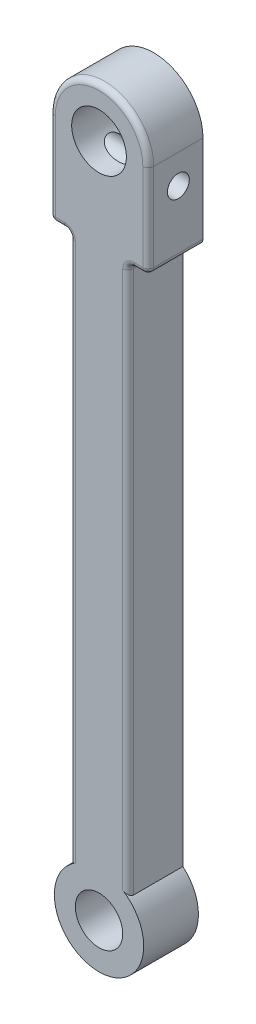
ISO-10303-21;
HEADER;
FILE_DESCRIPTION(('STEP AP214'),'2;1');
FILE_NAME('part.step','',(''),(''),'','','');
FILE_SCHEMA(('AUTOMOTIVE_DESIGN { 1 0 10303 214 1 1 1 1 }'));
ENDSEC;
DATA;
#1=APPLICATION_CONTEXT('core data for automotive mechanical design processes');
#2=APPLICATION_PROTOCOL_DEFINITION('international standard','automotive_design',2000,#1);
#3=PRODUCT_CONTEXT('',#1,'mechanical');
#4=PRODUCT('Part','Part','',(#3));
#5=PRODUCT_RELATED_PRODUCT_CATEGORY('part','',(#4));
#6=PRODUCT_DEFINITION_FORMATION('','',#4);
#7=PRODUCT_DEFINITION_CONTEXT('part definition',#1,'design');
#8=PRODUCT_DEFINITION('design','',#6,#7);
#9=PRODUCT_DEFINITION_SHAPE('','',#8);
#10=(LENGTH_UNIT() NAMED_UNIT(*) SI_UNIT(.MILLI.,.METRE.));
#11=(NAMED_UNIT(*) PLANE_ANGLE_UNIT() SI_UNIT($,.RADIAN.));
#12=(NAMED_UNIT(*) SI_UNIT($,.STERADIAN.) SOLID_ANGLE_UNIT());
#13=UNCERTAINTY_MEASURE_WITH_UNIT(LENGTH_MEASURE(1.E-05),#10,'distance_accuracy_value','');
#14=(GEOMETRIC_REPRESENTATION_CONTEXT(3) GLOBAL_UNCERTAINTY_ASSIGNED_CONTEXT((#13)) GLOBAL_UNIT_ASSIGNED_CONTEXT((#10,
#11,#12)) REPRESENTATION_CONTEXT('',''));
#15=CARTESIAN_POINT('',(0.,0.,0.));
#16=DIRECTION('',(0.,0.,1.));
#17=DIRECTION('',(1.,0.,0.));
#18=AXIS2_PLACEMENT_3D('',#15,#16,#17);
#19=CARTESIAN_POINT('',(0.,0.,15.));
#20=DIRECTION('',(0.,0.,1.));
#21=DIRECTION('',(1.,0.,0.));
#22=AXIS2_PLACEMENT_3D('',#19,#20,#21);
#23=PLANE('',#22);
#24=CARTESIAN_POINT('',(0.,-185.,15.));
#25=DIRECTION('',(0.,0.,1.));
#26=DIRECTION('',(1.,0.,0.));
#27=AXIS2_PLACEMENT_3D('',#24,#25,#26);
#28=CIRCLE('',#27,12.25);
#29=CARTESIAN_POINT('',(-6.49999999999998,-174.616720171352,15.));
#30=VERTEX_POINT('',#29);
#31=CARTESIAN_POINT('',(6.50000000000002,-174.616720171352,15.));
#32=VERTEX_POINT('',#31);
#33=EDGE_CURVE('E199',#30,#32,#28,.T.);
#34=ORIENTED_EDGE('',*,*,#33,.T.);
#35=DIRECTION('',(0.,1.,0.));
#36=VECTOR('',#35,1.);
#37=CARTESIAN_POINT('',(6.49999999999999,-27.,15.));
#38=LINE('',#37,#36);
#39=CARTESIAN_POINT('',(6.49999999999999,-27.,15.));
#40=VERTEX_POINT('',#39);
#41=EDGE_CURVE('E265',#32,#40,#38,.T.);
#42=ORIENTED_EDGE('',*,*,#41,.T.);
#43=CARTESIAN_POINT('',(9.49999999999999,-27.,15.));
#44=DIRECTION('',(0.,0.,1.));
#45=DIRECTION('',(1.,0.,0.));
#46=AXIS2_PLACEMENT_3D('',#43,#44,#45);
#47=CIRCLE('',#46,3.);
#48=CARTESIAN_POINT('',(9.50000000000001,-24.,15.));
#49=VERTEX_POINT('',#48);
#50=EDGE_CURVE('E263',#40,#49,#47,.F.);
#51=ORIENTED_EDGE('',*,*,#50,.T.);
#52=DIRECTION('',(1.,0.,0.));
#53=VECTOR('',#52,1.);
#54=CARTESIAN_POINT('',(12.,-24.,15.));
#55=LINE('',#54,#53);
#56=CARTESIAN_POINT('',(12.,-24.,15.));
#57=VERTEX_POINT('',#56);
#58=EDGE_CURVE('E177',#49,#57,#55,.T.);
#59=ORIENTED_EDGE('',*,*,#58,.T.);
#60=DIRECTION('',(0.,1.,0.));
#61=VECTOR('',#60,1.);
#62=CARTESIAN_POINT('',(12.,0.,15.));
#63=LINE('',#62,#61);
#64=CARTESIAN_POINT('',(12.,0.,15.));
#65=VERTEX_POINT('',#64);
#66=EDGE_CURVE('E250',#57,#65,#63,.T.);
#67=ORIENTED_EDGE('',*,*,#66,.T.);
#68=CARTESIAN_POINT('',(0.,0.,15.));
#69=DIRECTION('',(0.,0.,1.));
#70=DIRECTION('',(1.,0.,0.));
#71=AXIS2_PLACEMENT_3D('',#68,#69,#70);
#72=CIRCLE('',#71,12.);
#73=CARTESIAN_POINT('',(-12.,0.,15.));
#74=VERTEX_POINT('',#73);
#75=EDGE_CURVE('E252',#65,#74,#72,.T.);
#76=ORIENTED_EDGE('',*,*,#75,.T.);
#77=DIRECTION('',(0.,-1.,0.));
#78=VECTOR('',#77,1.);
#79=CARTESIAN_POINT('',(-12.,-24.,15.));
#80=LINE('',#79,#78);
#81=CARTESIAN_POINT('',(-12.,-24.,15.));
#82=VERTEX_POINT('',#81);
#83=EDGE_CURVE('E254',#74,#82,#80,.T.);
#84=ORIENTED_EDGE('',*,*,#83,.T.);
#85=DIRECTION('',(1.,0.,0.));
#86=VECTOR('',#85,1.);
#87=CARTESIAN_POINT('',(-9.49999999999998,-24.,15.));
#88=LINE('',#87,#86);
#89=CARTESIAN_POINT('',(-9.49999999999998,-24.,15.));
#90=VERTEX_POINT('',#89);
#91=EDGE_CURVE('E256',#82,#90,#88,.T.);
#92=ORIENTED_EDGE('',*,*,#91,.T.);
#93=CARTESIAN_POINT('',(-9.49999999999998,-27.,15.));
#94=DIRECTION('',(0.,0.,1.));
#95=DIRECTION('',(1.,0.,0.));
#96=AXIS2_PLACEMENT_3D('',#93,#94,#95);
#97=CIRCLE('',#96,3.);
#98=CARTESIAN_POINT('',(-6.49999999999998,-27.,15.));
#99=VERTEX_POINT('',#98);
#100=EDGE_CURVE('E258',#90,#99,#97,.F.);
#101=ORIENTED_EDGE('',*,*,#100,.T.);
#102=DIRECTION('',(0.,-1.,0.));
#103=VECTOR('',#102,1.);
#104=CARTESIAN_POINT('',(-6.49999999999998,-175.72301234236,15.));
#105=LINE('',#104,#103);
#106=EDGE_CURVE('E260',#99,#30,#105,.T.);
#107=ORIENTED_EDGE('',*,*,#106,.T.);
#108=EDGE_LOOP('',(#34,#42,#51,#59,#67,#76,#84,#92,#101,#107));
#109=FACE_BOUND('',#108,.T.);
#110=CARTESIAN_POINT('',(0.,0.,15.));
#111=DIRECTION('',(0.,0.,1.));
#112=DIRECTION('',(1.,0.,0.));
#113=AXIS2_PLACEMENT_3D('',#110,#111,#112);
#114=CIRCLE('',#113,7.5);
#115=CARTESIAN_POINT('',(7.5,0.,15.));
#116=VERTEX_POINT('',#115);
#117=EDGE_CURVE('E193',#116,#116,#114,.T.);
#118=ORIENTED_EDGE('',*,*,#117,.F.);
#119=EDGE_LOOP('',(#118));
#120=FACE_BOUND('',#119,.T.);
#121=CARTESIAN_POINT('',(0.,-185.,15.));
#122=DIRECTION('',(0.,0.,1.));
#123=DIRECTION('',(1.,0.,0.));
#124=AXIS2_PLACEMENT_3D('',#121,#122,#123);
#125=CIRCLE('',#124,6.5);
#126=CARTESIAN_POINT('',(6.50000000000003,-185.,15.));
#127=VERTEX_POINT('',#126);
#128=EDGE_CURVE('E428',#127,#127,#125,.T.);
#129=ORIENTED_EDGE('',*,*,#128,.F.);
#130=EDGE_LOOP('',(#129));
#131=FACE_BOUND('',#130,.T.);
#132=ADVANCED_FACE('F39',(#109,#120,#131),#23,.T.);
#133=CARTESIAN_POINT('',(0.,0.,0.));
#134=DIRECTION('',(0.,0.,1.));
#135=DIRECTION('',(1.,0.,0.));
#136=AXIS2_PLACEMENT_3D('',#133,#134,#135);
#137=PLANE('',#136);
#138=CARTESIAN_POINT('',(0.,0.,0.));
#139=DIRECTION('',(0.,0.,1.));
#140=DIRECTION('',(1.,0.,0.));
#141=AXIS2_PLACEMENT_3D('',#138,#139,#140);
#142=CIRCLE('',#141,13.5);
#143=CARTESIAN_POINT('',(13.5,0.,0.));
#144=VERTEX_POINT('',#143);
#145=CARTESIAN_POINT('',(-13.5,0.,0.));
#146=VERTEX_POINT('',#145);
#147=EDGE_CURVE('E185',#144,#146,#142,.T.);
#148=ORIENTED_EDGE('',*,*,#147,.F.);
#149=DIRECTION('',(0.,1.,0.));
#150=VECTOR('',#149,1.);
#151=CARTESIAN_POINT('',(13.5,0.,0.));
#152=LINE('',#151,#150);
#153=CARTESIAN_POINT('',(13.5,-24.,0.));
#154=VERTEX_POINT('',#153);
#155=EDGE_CURVE('E227',#154,#144,#152,.T.);
#156=ORIENTED_EDGE('',*,*,#155,.F.);
#157=CARTESIAN_POINT('',(12.,-24.,0.));
#158=DIRECTION('',(0.,0.,1.));
#159=DIRECTION('',(-1.,0.,0.));
#160=AXIS2_PLACEMENT_3D('',#157,#158,#159);
#161=CIRCLE('',#160,1.49999999999999);
#162=CARTESIAN_POINT('',(12.,-25.5,0.));
#163=VERTEX_POINT('',#162);
#164=EDGE_CURVE('E224',#163,#154,#161,.T.);
#165=ORIENTED_EDGE('',*,*,#164,.F.);
#166=DIRECTION('',(1.,0.,0.));
#167=VECTOR('',#166,1.);
#168=CARTESIAN_POINT('',(12.,-25.5,0.));
#169=LINE('',#168,#167);
#170=CARTESIAN_POINT('',(9.5,-25.5,0.));
#171=VERTEX_POINT('',#170);
#172=EDGE_CURVE('E221',#171,#163,#169,.T.);
#173=ORIENTED_EDGE('',*,*,#172,.F.);
#174=CARTESIAN_POINT('',(9.49999999999999,-27.,0.));
#175=DIRECTION('',(0.,0.,-1.));
#176=DIRECTION('',(-1.,0.,0.));
#177=AXIS2_PLACEMENT_3D('',#174,#175,#176);
#178=CIRCLE('',#177,1.5);
#179=CARTESIAN_POINT('',(7.99999999999999,-27.,0.));
#180=VERTEX_POINT('',#179);
#181=EDGE_CURVE('E218',#180,#171,#178,.T.);
#182=ORIENTED_EDGE('',*,*,#181,.F.);
#183=DIRECTION('',(0.,1.,0.));
#184=VECTOR('',#183,1.);
#185=CARTESIAN_POINT('',(8.00000000000002,-175.72301234236,0.));
#186=LINE('',#185,#184);
#187=CARTESIAN_POINT('',(8.00000000000002,-175.72301234236,0.));
#188=VERTEX_POINT('',#187);
#189=EDGE_CURVE('E215',#188,#180,#186,.T.);
#190=ORIENTED_EDGE('',*,*,#189,.F.);
#191=CARTESIAN_POINT('',(0.,-185.,0.));
#192=DIRECTION('',(0.,0.,1.));
#193=DIRECTION('',(1.,0.,0.));
#194=AXIS2_PLACEMENT_3D('',#191,#192,#193);
#195=CIRCLE('',#194,12.25);
#196=CARTESIAN_POINT('',(-7.99999999999998,-175.72301234236,0.));
#197=VERTEX_POINT('',#196);
#198=EDGE_CURVE('E212',#197,#188,#195,.T.);
#199=ORIENTED_EDGE('',*,*,#198,.F.);
#200=DIRECTION('',(0.,-1.,0.));
#201=VECTOR('',#200,1.);
#202=CARTESIAN_POINT('',(-7.99999999999998,-175.72301234236,0.));
#203=LINE('',#202,#201);
#204=CARTESIAN_POINT('',(-7.99999999999998,-27.,0.));
#205=VERTEX_POINT('',#204);
#206=EDGE_CURVE('E209',#205,#197,#203,.T.);
#207=ORIENTED_EDGE('',*,*,#206,.F.);
#208=CARTESIAN_POINT('',(-9.49999999999998,-27.,0.));
#209=DIRECTION('',(0.,0.,-1.));
#210=DIRECTION('',(1.,0.,0.));
#211=AXIS2_PLACEMENT_3D('',#208,#209,#210);
#212=CIRCLE('',#211,1.5);
#213=CARTESIAN_POINT('',(-9.49999999999998,-25.5,0.));
#214=VERTEX_POINT('',#213);
#215=EDGE_CURVE('E206',#214,#205,#212,.T.);
#216=ORIENTED_EDGE('',*,*,#215,.F.);
#217=DIRECTION('',(1.,0.,0.));
#218=VECTOR('',#217,1.);
#219=CARTESIAN_POINT('',(-12.,-25.5,0.));
#220=LINE('',#219,#218);
#221=CARTESIAN_POINT('',(-12.,-25.5,0.));
#222=VERTEX_POINT('',#221);
#223=EDGE_CURVE('E203',#222,#214,#220,.T.);
#224=ORIENTED_EDGE('',*,*,#223,.F.);
#225=CARTESIAN_POINT('',(-12.,-24.,0.));
#226=DIRECTION('',(0.,0.,1.));
#227=DIRECTION('',(1.,0.,0.));
#228=AXIS2_PLACEMENT_3D('',#225,#226,#227);
#229=CIRCLE('',#228,1.5);
#230=CARTESIAN_POINT('',(-13.5,-24.,0.));
#231=VERTEX_POINT('',#230);
#232=EDGE_CURVE('E188',#231,#222,#229,.T.);
#233=ORIENTED_EDGE('',*,*,#232,.F.);
#234=DIRECTION('',(0.,-1.,0.));
#235=VECTOR('',#234,1.);
#236=CARTESIAN_POINT('',(-13.5,0.,0.));
#237=LINE('',#236,#235);
#238=EDGE_CURVE('E170',#146,#231,#237,.T.);
#239=ORIENTED_EDGE('',*,*,#238,.F.);
#240=EDGE_LOOP('',(#148,#156,#165,#173,#182,#190,#199,#207,#216,#224,#233,#239));
#241=FACE_BOUND('',#240,.T.);
#242=CARTESIAN_POINT('',(0.,0.,0.));
#243=DIRECTION('',(0.,0.,1.));
#244=DIRECTION('',(1.,0.,0.));
#245=AXIS2_PLACEMENT_3D('',#242,#243,#244);
#246=CIRCLE('',#245,7.5);
#247=CARTESIAN_POINT('',(7.5,0.,0.));
#248=VERTEX_POINT('',#247);
#249=EDGE_CURVE('E196',#248,#248,#246,.T.);
#250=ORIENTED_EDGE('',*,*,#249,.T.);
#251=EDGE_LOOP('',(#250));
#252=FACE_BOUND('',#251,.T.);
#253=CARTESIAN_POINT('',(0.,-185.,0.));
#254=DIRECTION('',(0.,0.,1.));
#255=DIRECTION('',(1.,0.,0.));
#256=AXIS2_PLACEMENT_3D('',#253,#254,#255);
#257=CIRCLE('',#256,6.5);
#258=CARTESIAN_POINT('',(6.50000000000003,-185.,0.));
#259=VERTEX_POINT('',#258);
#260=EDGE_CURVE('E423',#259,#259,#257,.T.);
#261=ORIENTED_EDGE('',*,*,#260,.T.);
#262=EDGE_LOOP('',(#261));
#263=FACE_BOUND('',#262,.T.);
#264=ADVANCED_FACE('F182',(#241,#252,#263),#137,.F.);
#265=CARTESIAN_POINT('',(0.,0.,15.));
#266=DIRECTION('',(0.,0.,-1.));
#267=DIRECTION('',(-1.,0.,0.));
#268=AXIS2_PLACEMENT_3D('',#265,#266,#267);
#269=CYLINDRICAL_SURFACE('',#268,13.5);
#270=DIRECTION('',(0.,0.,-1.));
#271=VECTOR('',#270,1.);
#272=CARTESIAN_POINT('',(-13.5,0.,15.));
#273=LINE('',#272,#271);
#274=CARTESIAN_POINT('',(-13.5,0.,13.5));
#275=VERTEX_POINT('',#274);
#276=EDGE_CURVE('E166',#275,#146,#273,.T.);
#277=ORIENTED_EDGE('',*,*,#276,.F.);
#278=CARTESIAN_POINT('',(0.,0.,13.5));
#279=DIRECTION('',(0.,0.,1.));
#280=DIRECTION('',(1.,0.,0.));
#281=AXIS2_PLACEMENT_3D('',#278,#279,#280);
#282=CIRCLE('',#281,13.5);
#283=CARTESIAN_POINT('',(13.5,0.,13.5));
#284=VERTEX_POINT('',#283);
#285=EDGE_CURVE('E281',#275,#284,#282,.F.);
#286=ORIENTED_EDGE('',*,*,#285,.T.);
#287=DIRECTION('',(0.,0.,-1.));
#288=VECTOR('',#287,1.);
#289=CARTESIAN_POINT('',(13.5,0.,15.));
#290=LINE('',#289,#288);
#291=EDGE_CURVE('E191',#284,#144,#290,.T.);
#292=ORIENTED_EDGE('',*,*,#291,.T.);
#293=ORIENTED_EDGE('',*,*,#147,.T.);
#294=EDGE_LOOP('',(#277,#286,#292,#293));
#295=FACE_BOUND('',#294,.T.);
#296=ADVANCED_FACE('F190',(#295),#269,.T.);
#297=CARTESIAN_POINT('',(-13.5,0.,15.));
#298=DIRECTION('',(1.,0.,0.));
#299=DIRECTION('',(0.,1.,0.));
#300=AXIS2_PLACEMENT_3D('',#297,#298,#299);
#301=PLANE('',#300);
#302=CARTESIAN_POINT('',(-13.5,-8.,6.75));
#303=DIRECTION('',(1.,0.,0.));
#304=DIRECTION('',(0.,1.,0.));
#305=AXIS2_PLACEMENT_3D('',#302,#303,#304);
#306=CIRCLE('',#305,3.);
#307=CARTESIAN_POINT('',(-13.5,-5.,6.75));
#308=VERTEX_POINT('',#307);
#309=EDGE_CURVE('E401',#308,#308,#306,.T.);
#310=ORIENTED_EDGE('',*,*,#309,.T.);
#311=EDGE_LOOP('',(#310));
#312=FACE_BOUND('',#311,.T.);
#313=DIRECTION('',(0.,0.,-1.));
#314=VECTOR('',#313,1.);
#315=CARTESIAN_POINT('',(-13.5,-24.,15.));
#316=LINE('',#315,#314);
#317=CARTESIAN_POINT('',(-13.5,-24.,13.5));
#318=VERTEX_POINT('',#317);
#319=EDGE_CURVE('E178',#318,#231,#316,.T.);
#320=ORIENTED_EDGE('',*,*,#319,.F.);
#321=DIRECTION('',(0.,-1.,0.));
#322=VECTOR('',#321,1.);
#323=CARTESIAN_POINT('',(-13.5,0.,13.5));
#324=LINE('',#323,#322);
#325=EDGE_CURVE('E173',#318,#275,#324,.F.);
#326=ORIENTED_EDGE('',*,*,#325,.T.);
#327=ORIENTED_EDGE('',*,*,#276,.T.);
#328=ORIENTED_EDGE('',*,*,#238,.T.);
#329=EDGE_LOOP('',(#320,#326,#327,#328));
#330=FACE_BOUND('',#329,.T.);
#331=ADVANCED_FACE('F169',(#312,#330),#301,.F.);
#332=CARTESIAN_POINT('',(-12.,-24.,15.));
#333=DIRECTION('',(0.,0.,-1.));
#334=DIRECTION('',(-1.,0.,0.));
#335=AXIS2_PLACEMENT_3D('',#332,#333,#334);
#336=CYLINDRICAL_SURFACE('',#335,1.5);
#337=DIRECTION('',(0.,0.,-1.));
#338=VECTOR('',#337,1.);
#339=CARTESIAN_POINT('',(-12.,-25.5,15.));
#340=LINE('',#339,#338);
#341=CARTESIAN_POINT('',(-12.,-25.5,13.5));
#342=VERTEX_POINT('',#341);
#343=EDGE_CURVE('E246',#342,#222,#340,.T.);
#344=ORIENTED_EDGE('',*,*,#343,.F.);
#345=CARTESIAN_POINT('',(-12.,-24.,13.5));
#346=DIRECTION('',(0.,0.,-1.));
#347=DIRECTION('',(-1.,0.,0.));
#348=AXIS2_PLACEMENT_3D('',#345,#346,#347);
#349=CIRCLE('',#348,1.5);
#350=EDGE_CURVE('E278',#342,#318,#349,.T.);
#351=ORIENTED_EDGE('',*,*,#350,.T.);
#352=ORIENTED_EDGE('',*,*,#319,.T.);
#353=ORIENTED_EDGE('',*,*,#232,.T.);
#354=EDGE_LOOP('',(#344,#351,#352,#353));
#355=FACE_BOUND('',#354,.T.);
#356=ADVANCED_FACE('F462',(#355),#336,.T.);
#357=CARTESIAN_POINT('',(-12.,-25.5,15.));
#358=DIRECTION('',(0.,1.,0.));
#359=DIRECTION('',(-1.,0.,0.));
#360=AXIS2_PLACEMENT_3D('',#357,#358,#359);
#361=PLANE('',#360);
#362=DIRECTION('',(0.,0.,-1.));
#363=VECTOR('',#362,1.);
#364=CARTESIAN_POINT('',(-9.49999999999998,-25.5,15.));
#365=LINE('',#364,#363);
#366=CARTESIAN_POINT('',(-9.49999999999998,-25.5,13.5));
#367=VERTEX_POINT('',#366);
#368=EDGE_CURVE('E244',#367,#214,#365,.T.);
#369=ORIENTED_EDGE('',*,*,#368,.F.);
#370=DIRECTION('',(1.,0.,0.));
#371=VECTOR('',#370,1.);
#372=CARTESIAN_POINT('',(-12.,-25.5,13.5));
#373=LINE('',#372,#371);
#374=EDGE_CURVE('E276',#367,#342,#373,.F.);
#375=ORIENTED_EDGE('',*,*,#374,.T.);
#376=ORIENTED_EDGE('',*,*,#343,.T.);
#377=ORIENTED_EDGE('',*,*,#223,.T.);
#378=EDGE_LOOP('',(#369,#375,#376,#377));
#379=FACE_BOUND('',#378,.T.);
#380=ADVANCED_FACE('F467',(#379),#361,.F.);
#381=CARTESIAN_POINT('',(-9.49999999999998,-27.,15.));
#382=DIRECTION('',(0.,0.,-1.));
#383=DIRECTION('',(-1.,0.,0.));
#384=AXIS2_PLACEMENT_3D('',#381,#382,#383);
#385=CYLINDRICAL_SURFACE('',#384,1.5);
#386=DIRECTION('',(0.,0.,-1.));
#387=VECTOR('',#386,1.);
#388=CARTESIAN_POINT('',(-7.99999999999998,-27.,15.));
#389=LINE('',#388,#387);
#390=CARTESIAN_POINT('',(-7.99999999999998,-27.,13.5));
#391=VERTEX_POINT('',#390);
#392=EDGE_CURVE('E242',#391,#205,#389,.T.);
#393=ORIENTED_EDGE('',*,*,#392,.F.);
#394=CARTESIAN_POINT('',(-9.49999999999998,-27.,13.5));
#395=DIRECTION('',(0.,0.,1.));
#396=DIRECTION('',(1.,0.,0.));
#397=AXIS2_PLACEMENT_3D('',#394,#395,#396);
#398=CIRCLE('',#397,1.5);
#399=EDGE_CURVE('E274',#391,#367,#398,.T.);
#400=ORIENTED_EDGE('',*,*,#399,.T.);
#401=ORIENTED_EDGE('',*,*,#368,.T.);
#402=ORIENTED_EDGE('',*,*,#215,.T.);
#403=EDGE_LOOP('',(#393,#400,#401,#402));
#404=FACE_BOUND('',#403,.T.);
#405=ADVANCED_FACE('F473',(#404),#385,.F.);
#406=CARTESIAN_POINT('',(-7.99999999999998,-175.72301234236,15.));
#407=DIRECTION('',(1.,0.,0.));
#408=DIRECTION('',(0.,0.,-1.));
#409=AXIS2_PLACEMENT_3D('',#406,#407,#408);
#410=PLANE('',#409);
#411=DIRECTION('',(0.,0.,-1.));
#412=VECTOR('',#411,1.);
#413=CARTESIAN_POINT('',(-7.99999999999998,-175.72301234236,15.));
#414=LINE('',#413,#412);
#415=CARTESIAN_POINT('',(-7.99999999999998,-175.72301234236,13.5));
#416=VERTEX_POINT('',#415);
#417=EDGE_CURVE('E240',#416,#197,#414,.T.);
#418=ORIENTED_EDGE('',*,*,#417,.F.);
#419=DIRECTION('',(0.,-1.,0.));
#420=VECTOR('',#419,1.);
#421=CARTESIAN_POINT('',(-7.99999999999998,-27.,13.5));
#422=LINE('',#421,#420);
#423=EDGE_CURVE('E272',#416,#391,#422,.F.);
#424=ORIENTED_EDGE('',*,*,#423,.T.);
#425=ORIENTED_EDGE('',*,*,#392,.T.);
#426=ORIENTED_EDGE('',*,*,#206,.T.);
#427=EDGE_LOOP('',(#418,#424,#425,#426));
#428=FACE_BOUND('',#427,.T.);
#429=ADVANCED_FACE('F383',(#428),#410,.F.);
#430=CARTESIAN_POINT('',(0.,-185.,15.));
#431=DIRECTION('',(0.,0.,-1.));
#432=DIRECTION('',(-1.,0.,0.));
#433=AXIS2_PLACEMENT_3D('',#430,#431,#432);
#434=CYLINDRICAL_SURFACE('',#433,12.25);
#435=ORIENTED_EDGE('',*,*,#198,.T.);
#436=DIRECTION('',(0.,0.,-1.));
#437=VECTOR('',#436,1.);
#438=CARTESIAN_POINT('',(8.00000000000002,-175.72301234236,15.));
#439=LINE('',#438,#437);
#440=CARTESIAN_POINT('',(8.00000000000002,-175.72301234236,13.5));
#441=VERTEX_POINT('',#440);
#442=EDGE_CURVE('E238',#441,#188,#439,.T.);
#443=ORIENTED_EDGE('',*,*,#442,.F.);
#444=CARTESIAN_POINT('',(8.00000000000002,-175.72301234236,13.5));
#445=CARTESIAN_POINT('',(8.0000081937939,-175.723021221073,13.5354615179331));
#446=CARTESIAN_POINT('',(7.99874276480915,-175.721928204404,13.570916527224));
#447=CARTESIAN_POINT('',(7.99372808519085,-175.717606388755,13.6414939768507));
#448=CARTESIAN_POINT('',(7.98998066629412,-175.714379164849,13.6766166430852));
#449=CARTESIAN_POINT('',(7.98010477118876,-175.70589071968,13.7459854749769));
#450=CARTESIAN_POINT('',(7.97399550919636,-175.700645913648,13.7802363952101));
#451=CARTESIAN_POINT('',(7.95950917670271,-175.68824373722,13.8478959621075));
#452=CARTESIAN_POINT('',(7.9511317964411,-175.681086105589,13.8813044930436));
#453=CARTESIAN_POINT('',(7.922842213021,-175.656998041989,13.9797516465003));
#454=CARTESIAN_POINT('',(7.89973519801721,-175.637419915151,14.0432649409309));
#455=CARTESIAN_POINT('',(7.84618927713693,-175.592501171523,14.1649978092126));
#456=CARTESIAN_POINT('',(7.81573363763998,-175.567147410456,14.2232048773131));
#457=CARTESIAN_POINT('',(7.73651683850187,-175.501985154735,14.3536786714451));
#458=CARTESIAN_POINT('',(7.68512132945173,-175.46026777534,14.4233981742843));
#459=CARTESIAN_POINT('',(7.57342162336585,-175.371350263402,14.5511862849664));
#460=CARTESIAN_POINT('',(7.51310631595128,-175.324143309017,14.6092401464107));
#461=CARTESIAN_POINT('',(7.3844796428057,-175.225614174513,14.7143710563693));
#462=CARTESIAN_POINT('',(7.31605848624538,-175.1742394016,14.7612633016055));
#463=CARTESIAN_POINT('',(7.17357994817821,-175.069739287844,14.8427676763991));
#464=CARTESIAN_POINT('',(7.09952456929583,-175.01661457277,14.877384144713));
#465=CARTESIAN_POINT('',(6.94008511112598,-174.905053365096,14.9367350910825));
#466=CARTESIAN_POINT('',(6.85428410542225,-174.846574900776,14.9602781918905));
#467=CARTESIAN_POINT('',(6.67926107927927,-174.73056646574,14.9918955044746));
#468=CARTESIAN_POINT('',(6.59003887178097,-174.673036547132,14.9999688691872));
#469=CARTESIAN_POINT('',(6.50000000000002,-174.616720171352,15.));
#470=B_SPLINE_CURVE_WITH_KNOTS('',3,(#444,#445,#446,#447,#448,#449,#450,#451,#452,#453,#454,
#455,#456,#457,#458,#459,#460,#461,#462,#463,#464,#465,#466,#467,#468,#469),.UNSPECIFIED.,.F.,
.F.,(4,2,2,2,2,2,2,2,2,2,2,2,4),(0.,0.106334538632156,0.212590688478528,0.318000013812609,
0.423423742326896,0.633507601065244,0.844074434837382,1.13093489252642,1.41815571703463,
1.70984453907981,2.00143016349282,2.31964834104627,2.63788394250932),.UNSPECIFIED.);
#471=EDGE_CURVE('E54',#441,#32,#470,.T.);
#472=ORIENTED_EDGE('',*,*,#471,.T.);
#473=ORIENTED_EDGE('',*,*,#33,.F.);
#474=CARTESIAN_POINT('',(-6.49999999999998,-174.616720171352,15.));
#475=CARTESIAN_POINT('',(-6.55404937852268,-174.650552092991,14.9999911412633));
#476=CARTESIAN_POINT('',(-6.6077900917656,-174.684785729662,14.9970782401528));
#477=CARTESIAN_POINT('',(-6.71430340231741,-174.753798343027,14.9855809394952));
#478=CARTESIAN_POINT('',(-6.76707605516228,-174.788577288224,14.9769968663458));
#479=CARTESIAN_POINT('',(-6.9238352754013,-174.893625788712,14.9428528920315));
#480=CARTESIAN_POINT('',(-7.02583224102016,-174.964336740999,14.9089032812567));
#481=CARTESIAN_POINT('',(-7.21486353149974,-175.099449059281,14.8225284136188));
#482=CARTESIAN_POINT('',(-7.30243929785034,-175.163962118198,14.7714449349736));
#483=CARTESIAN_POINT('',(-7.46736922282455,-175.288589030861,14.6509047454096));
#484=CARTESIAN_POINT('',(-7.54474810460922,-175.348713361258,14.5814937472111));
#485=CARTESIAN_POINT('',(-7.66530073666784,-175.444384997234,14.447453349788));
#486=CARTESIAN_POINT('',(-7.71187033330229,-175.481987709849,14.3873277690824));
#487=CARTESIAN_POINT('',(-7.79652403435357,-175.551206966801,14.2582595875946));
#488=CARTESIAN_POINT('',(-7.83461885814561,-175.582831065532,14.1893283006071));
#489=CARTESIAN_POINT('',(-7.894626999198,-175.633109860409,14.056226332056));
#490=CARTESIAN_POINT('',(-7.91819981095266,-175.653061943516,13.9932965997986));
#491=CARTESIAN_POINT('',(-7.95693427234823,-175.686013165016,13.8632103131781));
#492=CARTESIAN_POINT('',(-7.97211294454832,-175.699026372889,13.796062622872));
#493=CARTESIAN_POINT('',(-7.98836714268911,-175.71299047193,13.6902753073357));
#494=CARTESIAN_POINT('',(-7.99271623734178,-175.716734887682,13.6524694269735));
#495=CARTESIAN_POINT('',(-7.99853693588728,-175.721750574493,13.576450774822));
#496=CARTESIAN_POINT('',(-8.00000669876354,-175.723020263233,13.5382377584007));
#497=CARTESIAN_POINT('',(-7.99999999999998,-175.72301234236,13.5));
#498=B_SPLINE_CURVE_WITH_KNOTS('',3,(#474,#475,#476,#477,#478,#479,#480,#481,#482,#483,#484,
#485,#486,#487,#488,#489,#490,#491,#492,#493,#494,#495,#496,#497),.UNSPECIFIED.,.F.,.F.,(4,2,2,
2,2,2,2,2,2,2,2,4),(0.,0.191135863713985,0.382260727780028,0.766014632350106,1.12486772706868,
1.48283408508274,1.73645680159705,1.98975687430893,2.19921627509274,2.40824933872285,
2.52279394815561,2.6374117724183),.UNSPECIFIED.);
#499=EDGE_CURVE('E11',#30,#416,#498,.T.);
#500=ORIENTED_EDGE('',*,*,#499,.T.);
#501=ORIENTED_EDGE('',*,*,#417,.T.);
#502=EDGE_LOOP('',(#435,#443,#472,#473,#500,#501));
#503=FACE_BOUND('',#502,.T.);
#504=ADVANCED_FACE('F299',(#503),#434,.T.);
#505=CARTESIAN_POINT('',(8.00000000000002,-175.72301234236,15.));
#506=DIRECTION('',(-1.,0.,0.));
#507=DIRECTION('',(0.,-1.,0.));
#508=AXIS2_PLACEMENT_3D('',#505,#506,#507);
#509=PLANE('',#508);
#510=DIRECTION('',(0.,0.,-1.));
#511=VECTOR('',#510,1.);
#512=CARTESIAN_POINT('',(7.99999999999999,-27.,15.));
#513=LINE('',#512,#511);
#514=CARTESIAN_POINT('',(7.99999999999999,-27.,13.5));
#515=VERTEX_POINT('',#514);
#516=EDGE_CURVE('E236',#515,#180,#513,.T.);
#517=ORIENTED_EDGE('',*,*,#516,.F.);
#518=DIRECTION('',(0.,1.,0.));
#519=VECTOR('',#518,1.);
#520=CARTESIAN_POINT('',(8.00000000000002,-175.72301234236,13.5));
#521=LINE('',#520,#519);
#522=EDGE_CURVE('E268',#515,#441,#521,.F.);
#523=ORIENTED_EDGE('',*,*,#522,.T.);
#524=ORIENTED_EDGE('',*,*,#442,.T.);
#525=ORIENTED_EDGE('',*,*,#189,.T.);
#526=EDGE_LOOP('',(#517,#523,#524,#525));
#527=FACE_BOUND('',#526,.T.);
#528=ADVANCED_FACE('F376',(#527),#509,.F.);
#529=CARTESIAN_POINT('',(9.49999999999999,-27.,15.));
#530=DIRECTION('',(0.,0.,-1.));
#531=DIRECTION('',(-1.,0.,0.));
#532=AXIS2_PLACEMENT_3D('',#529,#530,#531);
#533=CYLINDRICAL_SURFACE('',#532,1.5);
#534=DIRECTION('',(0.,0.,-1.));
#535=VECTOR('',#534,1.);
#536=CARTESIAN_POINT('',(9.5,-25.5,15.));
#537=LINE('',#536,#535);
#538=CARTESIAN_POINT('',(9.5,-25.5,13.5));
#539=VERTEX_POINT('',#538);
#540=EDGE_CURVE('E234',#539,#171,#537,.T.);
#541=ORIENTED_EDGE('',*,*,#540,.F.);
#542=CARTESIAN_POINT('',(9.49999999999999,-27.,13.5));
#543=DIRECTION('',(0.,0.,1.));
#544=DIRECTION('',(1.,0.,0.));
#545=AXIS2_PLACEMENT_3D('',#542,#543,#544);
#546=CIRCLE('',#545,1.5);
#547=EDGE_CURVE('E270',#539,#515,#546,.T.);
#548=ORIENTED_EDGE('',*,*,#547,.T.);
#549=ORIENTED_EDGE('',*,*,#516,.T.);
#550=ORIENTED_EDGE('',*,*,#181,.T.);
#551=EDGE_LOOP('',(#541,#548,#549,#550));
#552=FACE_BOUND('',#551,.T.);
#553=ADVANCED_FACE('F373',(#552),#533,.F.);
#554=CARTESIAN_POINT('',(12.,-25.5,15.));
#555=DIRECTION('',(0.,1.,0.));
#556=DIRECTION('',(-1.,0.,0.));
#557=AXIS2_PLACEMENT_3D('',#554,#555,#556);
#558=PLANE('',#557);
#559=DIRECTION('',(0.,0.,-1.));
#560=VECTOR('',#559,1.);
#561=CARTESIAN_POINT('',(12.,-25.5,15.));
#562=LINE('',#561,#560);
#563=CARTESIAN_POINT('',(12.,-25.5,13.5));
#564=VERTEX_POINT('',#563);
#565=EDGE_CURVE('E232',#564,#163,#562,.T.);
#566=ORIENTED_EDGE('',*,*,#565,.F.);
#567=DIRECTION('',(1.,0.,0.));
#568=VECTOR('',#567,1.);
#569=CARTESIAN_POINT('',(9.5,-25.5,13.5));
#570=LINE('',#569,#568);
#571=EDGE_CURVE('E285',#564,#539,#570,.F.);
#572=ORIENTED_EDGE('',*,*,#571,.T.);
#573=ORIENTED_EDGE('',*,*,#540,.T.);
#574=ORIENTED_EDGE('',*,*,#172,.T.);
#575=EDGE_LOOP('',(#566,#572,#573,#574));
#576=FACE_BOUND('',#575,.T.);
#577=ADVANCED_FACE('F370',(#576),#558,.F.);
#578=CARTESIAN_POINT('',(12.,-24.,15.));
#579=DIRECTION('',(0.,0.,-1.));
#580=DIRECTION('',(-1.,0.,0.));
#581=AXIS2_PLACEMENT_3D('',#578,#579,#580);
#582=CYLINDRICAL_SURFACE('',#581,1.49999999999999);
#583=DIRECTION('',(0.,0.,-1.));
#584=VECTOR('',#583,1.);
#585=CARTESIAN_POINT('',(13.5,-24.,15.));
#586=LINE('',#585,#584);
#587=CARTESIAN_POINT('',(13.5,-24.,13.5));
#588=VERTEX_POINT('',#587);
#589=EDGE_CURVE('E230',#588,#154,#586,.T.);
#590=ORIENTED_EDGE('',*,*,#589,.F.);
#591=CARTESIAN_POINT('',(12.,-24.,13.5));
#592=DIRECTION('',(0.,0.,-1.));
#593=DIRECTION('',(-1.,0.,0.));
#594=AXIS2_PLACEMENT_3D('',#591,#592,#593);
#595=CIRCLE('',#594,1.49999999999999);
#596=EDGE_CURVE('E62',#588,#564,#595,.T.);
#597=ORIENTED_EDGE('',*,*,#596,.T.);
#598=ORIENTED_EDGE('',*,*,#565,.T.);
#599=ORIENTED_EDGE('',*,*,#164,.T.);
#600=EDGE_LOOP('',(#590,#597,#598,#599));
#601=FACE_BOUND('',#600,.T.);
#602=ADVANCED_FACE('F366',(#601),#582,.T.);
#603=CARTESIAN_POINT('',(13.5,0.,15.));
#604=DIRECTION('',(-1.,0.,0.));
#605=DIRECTION('',(0.,-1.,0.));
#606=AXIS2_PLACEMENT_3D('',#603,#604,#605);
#607=PLANE('',#606);
#608=CARTESIAN_POINT('',(13.5,-8.,6.75));
#609=DIRECTION('',(1.,0.,0.));
#610=DIRECTION('',(0.,1.,0.));
#611=AXIS2_PLACEMENT_3D('',#608,#609,#610);
#612=CIRCLE('',#611,3.);
#613=CARTESIAN_POINT('',(13.5,-5.,6.75));
#614=VERTEX_POINT('',#613);
#615=EDGE_CURVE('E458',#614,#614,#612,.T.);
#616=ORIENTED_EDGE('',*,*,#615,.F.);
#617=EDGE_LOOP('',(#616));
#618=FACE_BOUND('',#617,.T.);
#619=ORIENTED_EDGE('',*,*,#291,.F.);
#620=DIRECTION('',(0.,1.,0.));
#621=VECTOR('',#620,1.);
#622=CARTESIAN_POINT('',(13.5,-24.,13.5));
#623=LINE('',#622,#621);
#624=EDGE_CURVE('E70',#284,#588,#623,.F.);
#625=ORIENTED_EDGE('',*,*,#624,.T.);
#626=ORIENTED_EDGE('',*,*,#589,.T.);
#627=ORIENTED_EDGE('',*,*,#155,.T.);
#628=EDGE_LOOP('',(#619,#625,#626,#627));
#629=FACE_BOUND('',#628,.T.);
#630=ADVANCED_FACE('F363',(#618,#629),#607,.F.);
#631=CARTESIAN_POINT('',(0.,0.,15.));
#632=DIRECTION('',(0.,0.,-1.));
#633=DIRECTION('',(-1.,0.,0.));
#634=AXIS2_PLACEMENT_3D('',#631,#632,#633);
#635=CYLINDRICAL_SURFACE('',#634,7.5);
#636=CARTESIAN_POINT('',(-5.59016994374948,-5.,6.75));
#637=CARTESIAN_POINT('',(-5.59016553143834,-5.00001084603855,6.88181897697783));
#638=CARTESIAN_POINT('',(-5.58237763184069,-5.00875480310781,7.01377252130936));
#639=CARTESIAN_POINT('',(-5.55132353635769,-5.04314542588996,7.27369764333525));
#640=CARTESIAN_POINT('',(-5.52803453776383,-5.06881699224294,7.40166306361178));
#641=CARTESIAN_POINT('',(-5.46647948020365,-5.13513624351944,7.64941465239346));
#642=CARTESIAN_POINT('',(-5.42825813587825,-5.17573919555889,7.76922399792594));
#643=CARTESIAN_POINT('',(-5.33761650767146,-5.2691611482906,7.99812419027236));
#644=CARTESIAN_POINT('',(-5.28519892709279,-5.32197782291856,8.10721707237296));
#645=CARTESIAN_POINT('',(-5.16538876701421,-5.43837638208655,8.31615888661557));
#646=CARTESIAN_POINT('',(-5.09756812935282,-5.50225027842516,8.41559675451036));
#647=CARTESIAN_POINT('',(-4.9495090627831,-5.63580340671859,8.60029261410909));
#648=CARTESIAN_POINT('',(-4.86926511208429,-5.70548521372697,8.68554426533459));
#649=CARTESIAN_POINT('',(-4.72039129862299,-5.82878133494764,8.82169552251189));
#650=CARTESIAN_POINT('',(-4.65416388570532,-5.8818642998623,8.87576443639007));
#651=CARTESIAN_POINT('',(-4.51650927860161,-5.98821378368204,8.97667682865367));
#652=CARTESIAN_POINT('',(-4.44508009982444,-6.04148036517901,9.02351752782877));
#653=CARTESIAN_POINT('',(-4.29757363141725,-6.14728519029878,9.11054030864835));
#654=CARTESIAN_POINT('',(-4.22148882305351,-6.19982207816089,9.15071120837702));
#655=CARTESIAN_POINT('',(-4.06534766823964,-6.30331116805016,9.22493468802997));
#656=CARTESIAN_POINT('',(-3.98529008330501,-6.35426286774999,9.25898534452713));
#657=CARTESIAN_POINT('',(-3.78388418406252,-6.47702218630798,9.33610978098142));
#658=CARTESIAN_POINT('',(-3.66057011231216,-6.5475716590242,9.37606872679507));
#659=CARTESIAN_POINT('',(-3.40797012158691,-6.68253563427638,9.44630803554955));
#660=CARTESIAN_POINT('',(-3.2786814602051,-6.74694727709433,9.47658390231107));
#661=CARTESIAN_POINT('',(-3.01507560019002,-6.86880177028073,9.52935356621248));
#662=CARTESIAN_POINT('',(-2.88075040190388,-6.92623286160946,9.55183434703612));
#663=CARTESIAN_POINT('',(-2.6082232196363,-7.03339351525223,9.59058317376206));
#664=CARTESIAN_POINT('',(-2.47002130406583,-7.08312321336898,9.60685132922226));
#665=CARTESIAN_POINT('',(-2.14074555238013,-7.1907534496085,9.63952135093915));
#666=CARTESIAN_POINT('',(-1.94835698466556,-7.24526474300481,9.6539109403119));
#667=CARTESIAN_POINT('',(-1.55947966656786,-7.33880471816399,9.67662425856727));
#668=CARTESIAN_POINT('',(-1.36298964722191,-7.37782853116311,9.68494608062701));
#669=CARTESIAN_POINT('',(-0.967327877639397,-7.44005324174329,9.69745109211502));
#670=CARTESIAN_POINT('',(-0.76815526129902,-7.46324889779726,9.70163291077903));
#671=CARTESIAN_POINT('',(-0.368580774922842,-7.49361678936032,9.70699390144527));
#672=CARTESIAN_POINT('',(-0.168179051758922,-7.50079090334362,9.70817342545916));
#673=CARTESIAN_POINT('',(0.234333666462498,-7.49906331989856,9.70788171656443));
#674=CARTESIAN_POINT('',(0.43644404566243,-7.49001837686624,9.70638686401187));
#675=CARTESIAN_POINT('',(0.839260733023055,-7.45563575125499,9.70024963939669));
#676=CARTESIAN_POINT('',(1.03996683507746,-7.43029572572712,9.6956068147053));
#677=CARTESIAN_POINT('',(1.43843465500268,-7.36353832975049,9.68190658089011));
#678=CARTESIAN_POINT('',(1.63619781835701,-7.32212914213103,9.67285141804294));
#679=CARTESIAN_POINT('',(2.027332980553,-7.22361051297357,9.64824185075886));
#680=CARTESIAN_POINT('',(2.22070660631061,-7.16650699466575,9.63268989714023));
#681=CARTESIAN_POINT('',(2.54290992858832,-7.05712629523865,9.59836320516473));
#682=CARTESIAN_POINT('',(2.67333529082557,-7.0087460573743,9.58204221498556));
#683=CARTESIAN_POINT('',(2.93056090894456,-6.90514439030485,9.54362636164651));
#684=CARTESIAN_POINT('',(3.05736202932947,-6.84992460960717,9.52153288838616));
#685=CARTESIAN_POINT('',(3.30635324404744,-6.73326823898284,9.47019208690502));
#686=CARTESIAN_POINT('',(3.42855018945115,-6.67184143083183,9.44095591499988));
#687=CARTESIAN_POINT('',(3.6675377583218,-6.54351084811059,9.37371595387478));
#688=CARTESIAN_POINT('',(3.78433039809341,-6.47660914239892,9.3357154667409));
#689=CARTESIAN_POINT('',(3.97709098141059,-6.35935316402903,9.26227176932622));
#690=CARTESIAN_POINT('',(4.0547506524646,-6.3100915203972,9.22951201060348));
#691=CARTESIAN_POINT('',(4.20637249937044,-6.21004602973465,9.15828476612244));
#692=CARTESIAN_POINT('',(4.28033570918836,-6.1592626148003,9.11981888854926));
#693=CARTESIAN_POINT('',(4.42398347668649,-6.0569081242837,9.03664287268622));
#694=CARTESIAN_POINT('',(4.49367219079246,-6.00533787676495,8.99193894328719));
#695=CARTESIAN_POINT('',(4.62824243623852,-5.90225102829499,8.89579070094008));
#696=CARTESIAN_POINT('',(4.69312504412111,-5.85073441789391,8.84434790465351));
#697=CARTESIAN_POINT('',(4.85378129227298,-5.71899870094458,8.70221125610987));
#698=CARTESIAN_POINT('',(4.94552355519132,-5.63954753522402,8.60611330621027));
#699=CARTESIAN_POINT('',(5.11296554970266,-5.48820142484164,8.39548202576687));
#700=CARTESIAN_POINT('',(5.18867029951295,-5.41630412009913,8.28095448173019));
#701=CARTESIAN_POINT('',(5.28874020922554,-5.31803155001595,8.09610606976124));
#702=CARTESIAN_POINT('',(5.31995946630474,-5.28674977340982,8.03199266250969));
#703=CARTESIAN_POINT('',(5.37752571429719,-5.22818298050108,7.89988671692881));
#704=CARTESIAN_POINT('',(5.40387510413195,-5.20089599772711,7.83189611024358));
#705=CARTESIAN_POINT('',(5.45150952306882,-5.15094560624129,7.69253139751589));
#706=CARTESIAN_POINT('',(5.47279537366206,-5.12828144762355,7.62115784256766));
#707=CARTESIAN_POINT('',(5.5101602842175,-5.08811150789047,7.47567951656539));
#708=CARTESIAN_POINT('',(5.52624013782293,-5.0706049405479,7.40157516373605));
#709=CARTESIAN_POINT('',(5.56293244275242,-5.03041042607361,7.19618190263026));
#710=CARTESIAN_POINT('',(5.57824185077774,-5.01331545495415,7.06275410790323));
#711=CARTESIAN_POINT('',(5.59259151396112,-4.9973030068238,6.79404944151584));
#712=CARTESIAN_POINT('',(5.59163894870452,-4.99837750807365,6.65877341219936));
#713=CARTESIAN_POINT('',(5.57409475082129,-5.0179289056876,6.39909430776869));
#714=CARTESIAN_POINT('',(5.55848515354627,-5.03531298390668,6.27454042972318));
#715=CARTESIAN_POINT('',(5.51327548518455,-5.08477181620062,6.03105710818138));
#716=CARTESIAN_POINT('',(5.48367706967405,-5.1168448318263,5.91212700094377));
#717=CARTESIAN_POINT('',(5.41043816198836,-5.19422947408422,5.68100954656456));
#718=CARTESIAN_POINT('',(5.36658438031372,-5.23974115746679,5.56895747541548));
#719=CARTESIAN_POINT('',(5.26584623709295,-5.34096861118748,5.35591274099308));
#720=CARTESIAN_POINT('',(5.20895871158291,-5.3966868585272,5.25492277187709));
#721=CARTESIAN_POINT('',(5.07779317937626,-5.52040017064885,5.05695971676676));
#722=CARTESIAN_POINT('',(5.00242622566926,-5.58904381865359,4.96111959252042));
#723=CARTESIAN_POINT('',(4.83938872667406,-5.73079180031803,4.78440822123687));
#724=CARTESIAN_POINT('',(4.75171173632194,-5.80389845923383,4.703544867229));
#725=CARTESIAN_POINT('',(4.58759265588334,-5.93399465848997,4.57330132819508));
#726=CARTESIAN_POINT('',(4.51328103245712,-5.99077768546521,4.52097311719956));
#727=CARTESIAN_POINT('',(4.35927905369845,-6.10375320719733,4.42410525282819));
#728=CARTESIAN_POINT('',(4.27958639181042,-6.15994543663088,4.37956896917538));
#729=CARTESIAN_POINT('',(4.11543390035926,-6.27080813428482,4.29751905202329));
#730=CARTESIAN_POINT('',(4.03096545433071,-6.32547556785315,4.26001867531642));
#731=CARTESIAN_POINT('',(3.85802392828298,-6.43241793100004,4.19134334640176));
#732=CARTESIAN_POINT('',(3.7695495766547,-6.48469209013159,4.16017042020232));
#733=CARTESIAN_POINT('',(3.54603922848412,-6.61052031484475,4.089782720752));
#734=CARTESIAN_POINT('',(3.4089646523801,-6.68230016836889,4.05384812650225));
#735=CARTESIAN_POINT('',(3.12883453724965,-6.81796582133713,3.99167390738365));
#736=CARTESIAN_POINT('',(2.98577619112615,-6.88184785890143,3.96543889085609));
#737=CARTESIAN_POINT('',(2.69472259336478,-7.00094485755115,3.92052215966275));
#738=CARTESIAN_POINT('',(2.54672056327249,-7.05614727215339,3.90185131877091));
#739=CARTESIAN_POINT('',(2.24699815465496,-7.15723588783104,3.87032184475868));
#740=CARTESIAN_POINT('',(2.09527789964746,-7.20312239790769,3.85746301884095));
#741=CARTESIAN_POINT('',(1.74526947684215,-7.29695455107754,3.83302869536624));
#742=CARTESIAN_POINT('',(1.54603486500282,-7.34175874817404,3.82286382169244));
#743=CARTESIAN_POINT('',(1.14437252365249,-7.41499252352524,3.80735487091471));
#744=CARTESIAN_POINT('',(0.941944015160615,-7.44341804160871,3.80201198896639));
#745=CARTESIAN_POINT('',(0.535283765670446,-7.48366466368223,3.79469668499215));
#746=CARTESIAN_POINT('',(0.331051191657411,-7.49547764505741,3.7927259116395));
#747=CARTESIAN_POINT('',(-0.0776807024274467,-7.50238231545967,3.79155643607953));
#748=CARTESIAN_POINT('',(-0.282179991862566,-7.4974757804161,3.79235743945716));
#749=CARTESIAN_POINT('',(-0.690996847379414,-7.47092185279861,3.79699144859864));
#750=CARTESIAN_POINT('',(-0.895309309099608,-7.44919803305845,3.8008382982179));
#751=CARTESIAN_POINT('',(-1.30139987145594,-7.38907911675407,3.81270266236392));
#752=CARTESIAN_POINT('',(-1.50317743828524,-7.35068056737025,3.82072104075312));
#753=CARTESIAN_POINT('',(-1.9023305630317,-7.25762239072419,3.84291199450214));
#754=CARTESIAN_POINT('',(-2.09971163061909,-7.2029845091007,3.85707635154429));
#755=CARTESIAN_POINT('',(-2.48853547128109,-7.07805146907057,3.89443143880998));
#756=CARTESIAN_POINT('',(-2.67998174216241,-7.00776574093536,3.9176167387721));
#757=CARTESIAN_POINT('',(-2.98056722076426,-6.88340406287285,3.96509351482766));
#758=CARTESIAN_POINT('',(-3.09227616590363,-6.8339321179547,3.98531055152708));
#759=CARTESIAN_POINT('',(-3.31217866003419,-6.73009967167892,4.03143686668257));
#760=CARTESIAN_POINT('',(-3.42037319573994,-6.67574055889015,4.05734453128649));
#761=CARTESIAN_POINT('',(-3.63245339301972,-6.56275018438268,4.1159241411207));
#762=CARTESIAN_POINT('',(-3.7363446625089,-6.50412477606615,4.14858692756725));
#763=CARTESIAN_POINT('',(-3.93912157533944,-6.38335822186684,4.22186748669149));
#764=CARTESIAN_POINT('',(-4.03800862491706,-6.32121807417286,4.26248300877281));
#765=CARTESIAN_POINT('',(-4.27731267790242,-6.16311507210212,4.37525620981655));
#766=CARTESIAN_POINT('',(-4.41413361508033,-6.06559835122556,4.4530871394476));
#767=CARTESIAN_POINT('',(-4.67067880321815,-5.87032153278293,4.63292905213029));
#768=CARTESIAN_POINT('',(-4.79042744918374,-5.7725619897584,4.73490496759138));
#769=CARTESIAN_POINT('',(-4.98709606874797,-5.60288546183379,4.94221984254996));
#770=CARTESIAN_POINT('',(-5.06780199739854,-5.52968280046912,5.04289986814543));
#771=CARTESIAN_POINT('',(-5.2135340555674,-5.39250237321641,5.26088415199519));
#772=CARTESIAN_POINT('',(-5.27855965790146,-5.32852491751569,5.37818896897686));
#773=CARTESIAN_POINT('',(-5.36311109201554,-5.24296460394398,5.56528786076895));
#774=CARTESIAN_POINT('',(-5.38921212404032,-5.21608834455143,5.62980526500552));
#775=CARTESIAN_POINT('',(-5.43679952071989,-5.16646778932023,5.76203809398121));
#776=CARTESIAN_POINT('',(-5.45828816269744,-5.14372145523006,5.82975192027722));
#777=CARTESIAN_POINT('',(-5.49648418399154,-5.10288592602761,5.9677577335316));
#778=CARTESIAN_POINT('',(-5.51319884662853,-5.08478964094469,6.03804560658731));
#779=CARTESIAN_POINT('',(-5.54178645293516,-5.0536175332245,6.18065444955774));
#780=CARTESIAN_POINT('',(-5.55366187963299,-5.040539136094,6.2529743564143));
#781=CARTESIAN_POINT('',(-5.57210031034736,-5.02014751325747,6.39581026688716));
#782=CARTESIAN_POINT('',(-5.57887318238835,-5.01260689970656,6.46626657590367));
#783=CARTESIAN_POINT('',(-5.58790910475072,-5.00253031114814,6.60780221574149));
#784=CARTESIAN_POINT('',(-5.59017232426293,-4.99999414838622,6.67888152308897));
#785=CARTESIAN_POINT('',(-5.59016994374948,-5.,6.75));
#786=B_SPLINE_CURVE_WITH_KNOTS('',3,(#636,#637,#638,#639,#640,#641,#642,#643,#644,#645,#646,
#647,#648,#649,#650,#651,#652,#653,#654,#655,#656,#657,#658,#659,#660,#661,#662,#663,#664,#665,
#666,#667,#668,#669,#670,#671,#672,#673,#674,#675,#676,#677,#678,#679,#680,#681,#682,#683,#684,
#685,#686,#687,#688,#689,#690,#691,#692,#693,#694,#695,#696,#697,#698,#699,#700,#701,#702,#703,
#704,#705,#706,#707,#708,#709,#710,#711,#712,#713,#714,#715,#716,#717,#718,#719,#720,#721,#722,
#723,#724,#725,#726,#727,#728,#729,#730,#731,#732,#733,#734,#735,#736,#737,#738,#739,#740,#741,
#742,#743,#744,#745,#746,#747,#748,#749,#750,#751,#752,#753,#754,#755,#756,#757,#758,#759,#760,
#761,#762,#763,#764,#765,#766,#767,#768,#769,#770,#771,#772,#773,#774,#775,#776,#777,#778,#779,
#780,#781,#782,#783,#784,#785),.UNSPECIFIED.,.T.,.F.,(4,2,2,2,2,2,2,2,2,2,2,2,2,2,2,2,2,2,2,2,2,
2,2,2,2,2,2,2,2,2,2,2,2,2,2,2,2,2,2,2,2,2,2,2,2,2,2,2,2,2,2,2,2,2,2,2,2,2,2,2,2,2,2,2,2,2,2,2,2,
2,2,2,2,2,4),(0.,0.395180906888465,0.790944428572302,1.18553181671633,1.58004411875688,
1.98726692257568,2.39467124712983,2.69618263158156,2.99780965825311,3.29993736527054,
3.60215985747408,4.04421914309693,4.48648339470947,4.92948262707437,5.37247404691212,
5.97309753752582,6.57390969549074,7.17492071722317,7.77586126864839,8.38213545319673,
8.9884968289059,9.59454983418977,10.2003744210951,10.6202774111547,11.0400793899193,
11.4592298176392,11.8782225814382,12.1708861300883,12.4634673520108,12.7557594104987,
13.0479857978691,13.5105015655918,13.9728723953732,14.2061849476201,14.4393822607837,
14.6725417149777,14.9056656077501,15.3094966809224,15.7131494691728,16.0915516040113,
16.4699089661792,16.8542101345229,17.2386046916696,17.6567802520636,18.0751755753162,
18.3962502026147,18.7174633415357,19.039275750406,19.3611910395252,19.8370064964959,
20.3130477272955,20.7897708767539,21.2664782110943,21.8790702234473,22.4918140282357,
23.104857326932,23.7178355108472,24.3336158832567,24.9495238255394,25.5646107101418,
26.1793279074641,26.550599172229,26.921765280745,27.292431412729,27.6629927987081,
28.2164785824435,28.7691653752555,29.212481001835,29.6558115309377,29.8793587372846,
30.1027953141772,30.3258891663871,30.5488684038196,30.7620829145258,30.975289425808),.UNSPECIFIED.);
#787=CARTESIAN_POINT('',(-5.59016994374948,-5.,6.75));
#788=VERTEX_POINT('',#787);
#789=EDGE_CURVE('E44',#788,#788,#786,.T.);
#790=ORIENTED_EDGE('',*,*,#789,.F.);
#791=EDGE_LOOP('',(#790));
#792=FACE_BOUND('',#791,.T.);
#793=ORIENTED_EDGE('',*,*,#117,.T.);
#794=EDGE_LOOP('',(#793));
#795=FACE_BOUND('',#794,.T.);
#796=ORIENTED_EDGE('',*,*,#249,.F.);
#797=EDGE_LOOP('',(#796));
#798=FACE_BOUND('',#797,.T.);
#799=ADVANCED_FACE('F359',(#792,#795,#798),#635,.F.);
#800=CARTESIAN_POINT('',(0.,-185.,15.));
#801=DIRECTION('',(0.,0.,-1.));
#802=DIRECTION('',(-1.,0.,0.));
#803=AXIS2_PLACEMENT_3D('',#800,#801,#802);
#804=CYLINDRICAL_SURFACE('',#803,6.5);
#805=ORIENTED_EDGE('',*,*,#128,.T.);
#806=EDGE_LOOP('',(#805));
#807=FACE_BOUND('',#806,.T.);
#808=ORIENTED_EDGE('',*,*,#260,.F.);
#809=EDGE_LOOP('',(#808));
#810=FACE_BOUND('',#809,.T.);
#811=ADVANCED_FACE('F348',(#807,#810),#804,.F.);
#812=CARTESIAN_POINT('',(-6.49999999999998,0.,13.5));
#813=DIRECTION('',(0.,1.,0.));
#814=DIRECTION('',(0.,0.,1.));
#815=AXIS2_PLACEMENT_3D('',#812,#813,#814);
#816=CYLINDRICAL_SURFACE('',#815,1.5);
#817=ORIENTED_EDGE('',*,*,#499,.F.);
#818=ORIENTED_EDGE('',*,*,#106,.F.);
#819=CARTESIAN_POINT('',(-6.49999999999998,-27.,13.5));
#820=DIRECTION('',(0.,1.,0.));
#821=DIRECTION('',(0.,0.,1.));
#822=AXIS2_PLACEMENT_3D('',#819,#820,#821);
#823=CIRCLE('',#822,1.5);
#824=EDGE_CURVE('E422',#391,#99,#823,.T.);
#825=ORIENTED_EDGE('',*,*,#824,.F.);
#826=ORIENTED_EDGE('',*,*,#423,.F.);
#827=EDGE_LOOP('',(#817,#818,#825,#826));
#828=FACE_BOUND('',#827,.T.);
#829=ADVANCED_FACE('F41',(#828),#816,.T.);
#830=CARTESIAN_POINT('',(-9.49999999999998,-27.,13.5));
#831=DIRECTION('',(0.,0.,1.));
#832=DIRECTION('',(1.,0.,0.));
#833=AXIS2_PLACEMENT_3D('',#830,#831,#832);
#834=TOROIDAL_SURFACE('',#833,3.,1.5);
#835=ORIENTED_EDGE('',*,*,#824,.T.);
#836=ORIENTED_EDGE('',*,*,#100,.F.);
#837=CARTESIAN_POINT('',(-9.49999999999998,-24.,13.5));
#838=DIRECTION('',(-1.,0.,0.));
#839=DIRECTION('',(0.,0.,1.));
#840=AXIS2_PLACEMENT_3D('',#837,#838,#839);
#841=CIRCLE('',#840,1.5);
#842=EDGE_CURVE('E420',#367,#90,#841,.T.);
#843=ORIENTED_EDGE('',*,*,#842,.F.);
#844=ORIENTED_EDGE('',*,*,#399,.F.);
#845=EDGE_LOOP('',(#835,#836,#843,#844));
#846=FACE_BOUND('',#845,.T.);
#847=ADVANCED_FACE('F341',(#846),#834,.T.);
#848=CARTESIAN_POINT('',(0.,-24.,13.5));
#849=DIRECTION('',(-1.,0.,0.));
#850=DIRECTION('',(0.,-1.,0.));
#851=AXIS2_PLACEMENT_3D('',#848,#849,#850);
#852=CYLINDRICAL_SURFACE('',#851,1.5);
#853=CARTESIAN_POINT('',(-12.,-24.,13.5));
#854=DIRECTION('',(-1.,0.,0.));
#855=DIRECTION('',(0.,-1.,0.));
#856=AXIS2_PLACEMENT_3D('',#853,#854,#855);
#857=CIRCLE('',#856,1.5);
#858=EDGE_CURVE('E417',#342,#82,#857,.T.);
#859=ORIENTED_EDGE('',*,*,#858,.F.);
#860=ORIENTED_EDGE('',*,*,#374,.F.);
#861=ORIENTED_EDGE('',*,*,#842,.T.);
#862=ORIENTED_EDGE('',*,*,#91,.F.);
#863=EDGE_LOOP('',(#859,#860,#861,#862));
#864=FACE_BOUND('',#863,.T.);
#865=ADVANCED_FACE('F338',(#864),#852,.T.);
#866=CARTESIAN_POINT('',(-12.,-24.,13.5));
#867=DIRECTION('',(0.,0.,1.));
#868=DIRECTION('',(1.,0.,0.));
#869=AXIS2_PLACEMENT_3D('',#866,#867,#868);
#870=SPHERICAL_SURFACE('',#869,1.5);
#871=ORIENTED_EDGE('',*,*,#350,.F.);
#872=ORIENTED_EDGE('',*,*,#858,.T.);
#873=CARTESIAN_POINT('',(-12.,-24.,13.5));
#874=DIRECTION('',(0.,1.,0.));
#875=DIRECTION('',(0.,0.,1.));
#876=AXIS2_PLACEMENT_3D('',#873,#874,#875);
#877=CIRCLE('',#876,1.5);
#878=EDGE_CURVE('E414',#318,#82,#877,.T.);
#879=ORIENTED_EDGE('',*,*,#878,.F.);
#880=EDGE_LOOP('',(#871,#872,#879));
#881=FACE_BOUND('',#880,.T.);
#882=ADVANCED_FACE('F334',(#881),#870,.T.);
#883=CARTESIAN_POINT('',(-12.,0.,13.5));
#884=DIRECTION('',(0.,1.,0.));
#885=DIRECTION('',(-1.,0.,0.));
#886=AXIS2_PLACEMENT_3D('',#883,#884,#885);
#887=CYLINDRICAL_SURFACE('',#886,1.5);
#888=ORIENTED_EDGE('',*,*,#878,.T.);
#889=ORIENTED_EDGE('',*,*,#83,.F.);
#890=CARTESIAN_POINT('',(-12.,0.,13.5));
#891=DIRECTION('',(0.,1.,0.));
#892=DIRECTION('',(-1.,0.,0.));
#893=AXIS2_PLACEMENT_3D('',#890,#891,#892);
#894=CIRCLE('',#893,1.5);
#895=EDGE_CURVE('E411',#275,#74,#894,.T.);
#896=ORIENTED_EDGE('',*,*,#895,.F.);
#897=ORIENTED_EDGE('',*,*,#325,.F.);
#898=EDGE_LOOP('',(#888,#889,#896,#897));
#899=FACE_BOUND('',#898,.T.);
#900=ADVANCED_FACE('F330',(#899),#887,.T.);
#901=CARTESIAN_POINT('',(0.,0.,13.5));
#902=DIRECTION('',(0.,0.,1.));
#903=DIRECTION('',(1.,0.,0.));
#904=AXIS2_PLACEMENT_3D('',#901,#902,#903);
#905=TOROIDAL_SURFACE('',#904,12.,1.5);
#906=ORIENTED_EDGE('',*,*,#895,.T.);
#907=ORIENTED_EDGE('',*,*,#75,.F.);
#908=CARTESIAN_POINT('',(12.,0.,13.5));
#909=DIRECTION('',(0.,-1.,0.));
#910=DIRECTION('',(1.,0.,0.));
#911=AXIS2_PLACEMENT_3D('',#908,#909,#910);
#912=CIRCLE('',#911,1.5);
#913=EDGE_CURVE('E408',#284,#65,#912,.T.);
#914=ORIENTED_EDGE('',*,*,#913,.F.);
#915=ORIENTED_EDGE('',*,*,#285,.F.);
#916=EDGE_LOOP('',(#906,#907,#914,#915));
#917=FACE_BOUND('',#916,.T.);
#918=ADVANCED_FACE('F326',(#917),#905,.T.);
#919=CARTESIAN_POINT('',(12.,0.,13.5));
#920=DIRECTION('',(0.,-1.,0.));
#921=DIRECTION('',(1.,0.,0.));
#922=AXIS2_PLACEMENT_3D('',#919,#920,#921);
#923=CYLINDRICAL_SURFACE('',#922,1.5);
#924=CARTESIAN_POINT('',(12.,-24.,13.5));
#925=DIRECTION('',(0.,-1.,0.));
#926=DIRECTION('',(0.,0.,-1.));
#927=AXIS2_PLACEMENT_3D('',#924,#925,#926);
#928=CIRCLE('',#927,1.5);
#929=EDGE_CURVE('E405',#588,#57,#928,.T.);
#930=ORIENTED_EDGE('',*,*,#929,.F.);
#931=ORIENTED_EDGE('',*,*,#624,.F.);
#932=ORIENTED_EDGE('',*,*,#913,.T.);
#933=ORIENTED_EDGE('',*,*,#66,.F.);
#934=EDGE_LOOP('',(#930,#931,#932,#933));
#935=FACE_BOUND('',#934,.T.);
#936=ADVANCED_FACE('F322',(#935),#923,.T.);
#937=CARTESIAN_POINT('',(12.,-24.,13.5));
#938=DIRECTION('',(0.,0.,1.));
#939=DIRECTION('',(1.,0.,0.));
#940=AXIS2_PLACEMENT_3D('',#937,#938,#939);
#941=SPHERICAL_SURFACE('',#940,1.5);
#942=ORIENTED_EDGE('',*,*,#596,.F.);
#943=ORIENTED_EDGE('',*,*,#929,.T.);
#944=CARTESIAN_POINT('',(12.,-24.,13.5));
#945=DIRECTION('',(-1.,0.,0.));
#946=DIRECTION('',(0.,-1.,0.));
#947=AXIS2_PLACEMENT_3D('',#944,#945,#946);
#948=CIRCLE('',#947,1.5);
#949=EDGE_CURVE('E398',#564,#57,#948,.T.);
#950=ORIENTED_EDGE('',*,*,#949,.F.);
#951=EDGE_LOOP('',(#942,#943,#950));
#952=FACE_BOUND('',#951,.T.);
#953=ADVANCED_FACE('F318',(#952),#941,.T.);
#954=CARTESIAN_POINT('',(1.33226762955017E-13,-24.,13.5));
#955=DIRECTION('',(-1.,0.,0.));
#956=DIRECTION('',(0.,-1.,0.));
#957=AXIS2_PLACEMENT_3D('',#954,#955,#956);
#958=CYLINDRICAL_SURFACE('',#957,1.5);
#959=ORIENTED_EDGE('',*,*,#949,.T.);
#960=ORIENTED_EDGE('',*,*,#58,.F.);
#961=CARTESIAN_POINT('',(9.49999999999999,-24.,13.5));
#962=DIRECTION('',(-1.,0.,0.));
#963=DIRECTION('',(0.,0.,1.));
#964=AXIS2_PLACEMENT_3D('',#961,#962,#963);
#965=CIRCLE('',#964,1.5);
#966=EDGE_CURVE('E397',#539,#49,#965,.T.);
#967=ORIENTED_EDGE('',*,*,#966,.F.);
#968=ORIENTED_EDGE('',*,*,#571,.F.);
#969=EDGE_LOOP('',(#959,#960,#967,#968));
#970=FACE_BOUND('',#969,.T.);
#971=ADVANCED_FACE('F314',(#970),#958,.T.);
#972=CARTESIAN_POINT('',(9.49999999999999,-27.,13.5));
#973=DIRECTION('',(0.,0.,1.));
#974=DIRECTION('',(1.,0.,0.));
#975=AXIS2_PLACEMENT_3D('',#972,#973,#974);
#976=TOROIDAL_SURFACE('',#975,3.,1.5);
#977=ORIENTED_EDGE('',*,*,#966,.T.);
#978=ORIENTED_EDGE('',*,*,#50,.F.);
#979=CARTESIAN_POINT('',(6.49999999999999,-27.,13.5));
#980=DIRECTION('',(0.,-1.,0.));
#981=DIRECTION('',(0.,0.,-1.));
#982=AXIS2_PLACEMENT_3D('',#979,#980,#981);
#983=CIRCLE('',#982,1.5);
#984=EDGE_CURVE('E393',#515,#40,#983,.T.);
#985=ORIENTED_EDGE('',*,*,#984,.F.);
#986=ORIENTED_EDGE('',*,*,#547,.F.);
#987=EDGE_LOOP('',(#977,#978,#985,#986));
#988=FACE_BOUND('',#987,.T.);
#989=ADVANCED_FACE('F309',(#988),#976,.T.);
#990=CARTESIAN_POINT('',(6.49999999999998,0.,13.5));
#991=DIRECTION('',(0.,-1.,0.));
#992=DIRECTION('',(1.,0.,0.));
#993=AXIS2_PLACEMENT_3D('',#990,#991,#992);
#994=CYLINDRICAL_SURFACE('',#993,1.5);
#995=ORIENTED_EDGE('',*,*,#471,.F.);
#996=ORIENTED_EDGE('',*,*,#522,.F.);
#997=ORIENTED_EDGE('',*,*,#984,.T.);
#998=ORIENTED_EDGE('',*,*,#41,.F.);
#999=EDGE_LOOP('',(#995,#996,#997,#998));
#1000=FACE_BOUND('',#999,.T.);
#1001=ADVANCED_FACE('F303',(#1000),#994,.T.);
#1002=CARTESIAN_POINT('',(-13.5,-8.,6.75));
#1003=DIRECTION('',(1.,0.,0.));
#1004=DIRECTION('',(0.,1.,0.));
#1005=AXIS2_PLACEMENT_3D('',#1002,#1003,#1004);
#1006=CYLINDRICAL_SURFACE('',#1005,3.);
#1007=ORIENTED_EDGE('',*,*,#789,.T.);
#1008=EDGE_LOOP('',(#1007));
#1009=FACE_BOUND('',#1008,.T.);
#1010=ORIENTED_EDGE('',*,*,#309,.F.);
#1011=EDGE_LOOP('',(#1010));
#1012=FACE_BOUND('',#1011,.T.);
#1013=ORIENTED_EDGE('',*,*,#615,.T.);
#1014=EDGE_LOOP('',(#1013));
#1015=FACE_BOUND('',#1014,.T.);
#1016=ADVANCED_FACE('F308',(#1009,#1012,#1015),#1006,.F.);
#1017=CLOSED_SHELL('',(#132,#264,#296,#331,#356,#380,#405,#429,#504,#528,#553,#577,#602,#630,
#799,#811,#829,#847,#865,#882,#900,#918,#936,#953,#971,#989,#1001,#1016));
#1018=MANIFOLD_SOLID_BREP('B2',#1017);
#1019=ADVANCED_BREP_SHAPE_REPRESENTATION('',(#18,#1018),#14);
#1020=SHAPE_DEFINITION_REPRESENTATION(#9,#1019);
ENDSEC;
END-ISO-10303-21;
